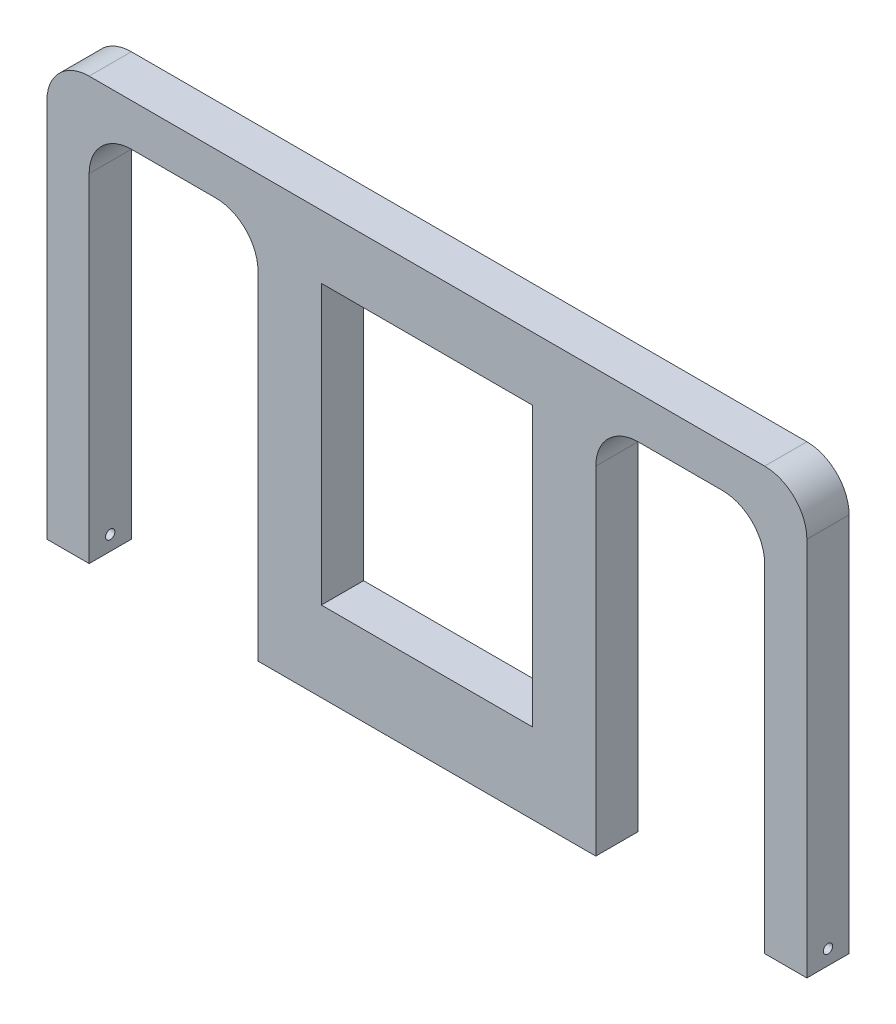
ISO-10303-21;
HEADER;
FILE_DESCRIPTION(('STEP AP214'),'2;1');
FILE_NAME('part.step','',(''),(''),'','','');
FILE_SCHEMA(('AUTOMOTIVE_DESIGN { 1 0 10303 214 1 1 1 1 }'));
ENDSEC;
DATA;
#1=APPLICATION_CONTEXT('core data for automotive mechanical design processes');
#2=APPLICATION_PROTOCOL_DEFINITION('international standard','automotive_design',2000,#1);
#3=PRODUCT_CONTEXT('',#1,'mechanical');
#4=PRODUCT('Part','Part','',(#3));
#5=PRODUCT_RELATED_PRODUCT_CATEGORY('part','',(#4));
#6=PRODUCT_DEFINITION_FORMATION('','',#4);
#7=PRODUCT_DEFINITION_CONTEXT('part definition',#1,'design');
#8=PRODUCT_DEFINITION('design','',#6,#7);
#9=PRODUCT_DEFINITION_SHAPE('','',#8);
#10=(LENGTH_UNIT() NAMED_UNIT(*) SI_UNIT(.MILLI.,.METRE.));
#11=(NAMED_UNIT(*) PLANE_ANGLE_UNIT() SI_UNIT($,.RADIAN.));
#12=(NAMED_UNIT(*) SI_UNIT($,.STERADIAN.) SOLID_ANGLE_UNIT());
#13=UNCERTAINTY_MEASURE_WITH_UNIT(LENGTH_MEASURE(1.E-05),#10,'distance_accuracy_value','');
#14=(GEOMETRIC_REPRESENTATION_CONTEXT(3) GLOBAL_UNCERTAINTY_ASSIGNED_CONTEXT((#13)) GLOBAL_UNIT_ASSIGNED_CONTEXT((#10,
#11,#12)) REPRESENTATION_CONTEXT('',''));
#15=CARTESIAN_POINT('',(0.,0.,0.));
#16=DIRECTION('',(0.,0.,1.));
#17=DIRECTION('',(1.,0.,0.));
#18=AXIS2_PLACEMENT_3D('',#15,#16,#17);
#19=CARTESIAN_POINT('',(-114.3,114.3,12.7));
#20=DIRECTION('',(0.,0.,-1.));
#21=DIRECTION('',(-1.,0.,0.));
#22=AXIS2_PLACEMENT_3D('',#19,#20,#21);
#23=PLANE('',#22);
#24=DIRECTION('',(-1.,0.,0.));
#25=VECTOR('',#24,1.);
#26=CARTESIAN_POINT('',(31.75,24.13,12.7));
#27=LINE('',#26,#25);
#28=CARTESIAN_POINT('',(31.75,24.13,12.7));
#29=VERTEX_POINT('',#28);
#30=CARTESIAN_POINT('',(-31.75,24.13,12.7));
#31=VERTEX_POINT('',#30);
#32=EDGE_CURVE('E189',#29,#31,#27,.T.);
#33=ORIENTED_EDGE('',*,*,#32,.T.);
#34=DIRECTION('',(0.,1.,0.));
#35=VECTOR('',#34,1.);
#36=CARTESIAN_POINT('',(-31.75,107.95,12.7));
#37=LINE('',#36,#35);
#38=CARTESIAN_POINT('',(-31.75,107.95,12.7));
#39=VERTEX_POINT('',#38);
#40=EDGE_CURVE('E183',#31,#39,#37,.T.);
#41=ORIENTED_EDGE('',*,*,#40,.T.);
#42=DIRECTION('',(1.,0.,0.));
#43=VECTOR('',#42,1.);
#44=CARTESIAN_POINT('',(31.75,107.95,12.7));
#45=LINE('',#44,#43);
#46=CARTESIAN_POINT('',(31.75,107.95,12.6999999999999));
#47=VERTEX_POINT('',#46);
#48=EDGE_CURVE('E192',#39,#47,#45,.T.);
#49=ORIENTED_EDGE('',*,*,#48,.T.);
#50=DIRECTION('',(0.,-1.,0.));
#51=VECTOR('',#50,1.);
#52=CARTESIAN_POINT('',(31.75,107.95,12.7));
#53=LINE('',#52,#51);
#54=EDGE_CURVE('E48',#47,#29,#53,.T.);
#55=ORIENTED_EDGE('',*,*,#54,.T.);
#56=EDGE_LOOP('',(#33,#41,#49,#55));
#57=FACE_BOUND('',#56,.T.);
#58=CARTESIAN_POINT('',(-101.6,114.3,12.7));
#59=DIRECTION('',(0.,0.,-1.));
#60=DIRECTION('',(-1.,0.,0.));
#61=AXIS2_PLACEMENT_3D('',#58,#59,#60);
#62=CIRCLE('',#61,12.7);
#63=CARTESIAN_POINT('',(-114.3,114.3,12.7));
#64=VERTEX_POINT('',#63);
#65=CARTESIAN_POINT('',(-101.6,127.,12.7));
#66=VERTEX_POINT('',#65);
#67=EDGE_CURVE('E217',#64,#66,#62,.T.);
#68=ORIENTED_EDGE('',*,*,#67,.F.);
#69=DIRECTION('',(0.,-1.,0.));
#70=VECTOR('',#69,1.);
#71=CARTESIAN_POINT('',(-114.3,114.3,12.7));
#72=LINE('',#71,#70);
#73=CARTESIAN_POINT('',(-114.3,0.,12.7));
#74=VERTEX_POINT('',#73);
#75=EDGE_CURVE('E11',#64,#74,#72,.T.);
#76=ORIENTED_EDGE('',*,*,#75,.T.);
#77=DIRECTION('',(1.,0.,0.));
#78=VECTOR('',#77,1.);
#79=CARTESIAN_POINT('',(-114.3,0.,12.7));
#80=LINE('',#79,#78);
#81=CARTESIAN_POINT('',(-101.6,0.,12.7));
#82=VERTEX_POINT('',#81);
#83=EDGE_CURVE('E349',#74,#82,#80,.T.);
#84=ORIENTED_EDGE('',*,*,#83,.T.);
#85=DIRECTION('',(0.,-1.,0.));
#86=VECTOR('',#85,1.);
#87=CARTESIAN_POINT('',(-101.6,114.3,12.7));
#88=LINE('',#87,#86);
#89=CARTESIAN_POINT('',(-101.6,101.6,12.7));
#90=VERTEX_POINT('',#89);
#91=EDGE_CURVE('E41',#90,#82,#88,.T.);
#92=ORIENTED_EDGE('',*,*,#91,.F.);
#93=CARTESIAN_POINT('',(-88.9,101.6,12.7));
#94=DIRECTION('',(0.,0.,-1.));
#95=DIRECTION('',(-1.,0.,0.));
#96=AXIS2_PLACEMENT_3D('',#93,#94,#95);
#97=CIRCLE('',#96,12.7);
#98=CARTESIAN_POINT('',(-88.9,114.3,12.7));
#99=VERTEX_POINT('',#98);
#100=EDGE_CURVE('E246',#90,#99,#97,.T.);
#101=ORIENTED_EDGE('',*,*,#100,.T.);
#102=DIRECTION('',(-1.,0.,0.));
#103=VECTOR('',#102,1.);
#104=CARTESIAN_POINT('',(114.3,114.3,12.7));
#105=LINE('',#104,#103);
#106=CARTESIAN_POINT('',(-63.5,114.3,12.7));
#107=VERTEX_POINT('',#106);
#108=EDGE_CURVE('E343',#107,#99,#105,.T.);
#109=ORIENTED_EDGE('',*,*,#108,.F.);
#110=CARTESIAN_POINT('',(-63.5,101.6,12.7));
#111=DIRECTION('',(0.,0.,-1.));
#112=DIRECTION('',(1.,0.,0.));
#113=AXIS2_PLACEMENT_3D('',#110,#111,#112);
#114=CIRCLE('',#113,12.7);
#115=CARTESIAN_POINT('',(-50.8,101.6,12.7));
#116=VERTEX_POINT('',#115);
#117=EDGE_CURVE('E237',#107,#116,#114,.T.);
#118=ORIENTED_EDGE('',*,*,#117,.T.);
#119=DIRECTION('',(0.,1.,0.));
#120=VECTOR('',#119,1.);
#121=CARTESIAN_POINT('',(-50.8,0.,12.6999999999999));
#122=LINE('',#121,#120);
#123=CARTESIAN_POINT('',(-50.8,0.,12.6999999999999));
#124=VERTEX_POINT('',#123);
#125=EDGE_CURVE('E301',#124,#116,#122,.T.);
#126=ORIENTED_EDGE('',*,*,#125,.F.);
#127=DIRECTION('',(-1.,0.,0.));
#128=VECTOR('',#127,1.);
#129=CARTESIAN_POINT('',(50.8,0.,12.6999999999999));
#130=LINE('',#129,#128);
#131=CARTESIAN_POINT('',(50.8,0.,12.6999999999999));
#132=VERTEX_POINT('',#131);
#133=EDGE_CURVE('E299',#132,#124,#130,.T.);
#134=ORIENTED_EDGE('',*,*,#133,.F.);
#135=DIRECTION('',(0.,1.,0.));
#136=VECTOR('',#135,1.);
#137=CARTESIAN_POINT('',(50.8,0.,12.6999999999999));
#138=LINE('',#137,#136);
#139=CARTESIAN_POINT('',(50.8,101.6,12.6999999999999));
#140=VERTEX_POINT('',#139);
#141=EDGE_CURVE('E304',#132,#140,#138,.T.);
#142=ORIENTED_EDGE('',*,*,#141,.T.);
#143=CARTESIAN_POINT('',(63.5,101.6,12.7));
#144=DIRECTION('',(0.,0.,1.));
#145=DIRECTION('',(-1.,0.,0.));
#146=AXIS2_PLACEMENT_3D('',#143,#144,#145);
#147=CIRCLE('',#146,12.7);
#148=CARTESIAN_POINT('',(63.5,114.3,12.7));
#149=VERTEX_POINT('',#148);
#150=EDGE_CURVE('E258',#149,#140,#147,.T.);
#151=ORIENTED_EDGE('',*,*,#150,.F.);
#152=CARTESIAN_POINT('',(88.9,114.3,12.6999999999998));
#153=VERTEX_POINT('',#152);
#154=EDGE_CURVE('E341',#153,#149,#105,.T.);
#155=ORIENTED_EDGE('',*,*,#154,.F.);
#156=CARTESIAN_POINT('',(88.9,101.6,12.7));
#157=DIRECTION('',(0.,0.,1.));
#158=DIRECTION('',(1.,0.,0.));
#159=AXIS2_PLACEMENT_3D('',#156,#157,#158);
#160=CIRCLE('',#159,12.7);
#161=CARTESIAN_POINT('',(101.6,101.6,12.7));
#162=VERTEX_POINT('',#161);
#163=EDGE_CURVE('E269',#162,#153,#160,.T.);
#164=ORIENTED_EDGE('',*,*,#163,.F.);
#165=DIRECTION('',(0.,-1.,0.));
#166=VECTOR('',#165,1.);
#167=CARTESIAN_POINT('',(101.6,114.3,12.7));
#168=LINE('',#167,#166);
#169=CARTESIAN_POINT('',(101.6,0.,12.7));
#170=VERTEX_POINT('',#169);
#171=EDGE_CURVE('E324',#162,#170,#168,.T.);
#172=ORIENTED_EDGE('',*,*,#171,.T.);
#173=DIRECTION('',(1.,0.,0.));
#174=VECTOR('',#173,1.);
#175=CARTESIAN_POINT('',(114.3,0.,12.7));
#176=LINE('',#175,#174);
#177=CARTESIAN_POINT('',(114.3,0.,12.7));
#178=VERTEX_POINT('',#177);
#179=EDGE_CURVE('E321',#170,#178,#176,.T.);
#180=ORIENTED_EDGE('',*,*,#179,.T.);
#181=DIRECTION('',(0.,1.,0.));
#182=VECTOR('',#181,1.);
#183=CARTESIAN_POINT('',(114.3,114.3,12.7));
#184=LINE('',#183,#182);
#185=CARTESIAN_POINT('',(114.3,114.3,12.7));
#186=VERTEX_POINT('',#185);
#187=EDGE_CURVE('E330',#178,#186,#184,.T.);
#188=ORIENTED_EDGE('',*,*,#187,.T.);
#189=CARTESIAN_POINT('',(101.6,114.3,12.7));
#190=DIRECTION('',(0.,0.,1.));
#191=DIRECTION('',(1.,0.,0.));
#192=AXIS2_PLACEMENT_3D('',#189,#190,#191);
#193=CIRCLE('',#192,12.7);
#194=CARTESIAN_POINT('',(101.6,127.,12.7));
#195=VERTEX_POINT('',#194);
#196=EDGE_CURVE('E227',#186,#195,#193,.T.);
#197=ORIENTED_EDGE('',*,*,#196,.T.);
#198=DIRECTION('',(-1.,0.,0.));
#199=VECTOR('',#198,1.);
#200=CARTESIAN_POINT('',(114.3,127.,12.7));
#201=LINE('',#200,#199);
#202=EDGE_CURVE('E338',#195,#66,#201,.T.);
#203=ORIENTED_EDGE('',*,*,#202,.T.);
#204=EDGE_LOOP('',(#68,#76,#84,#92,#101,#109,#118,#126,#134,#142,#151,#155,#164,#172,#180,#188,
#197,#203));
#205=FACE_BOUND('',#204,.T.);
#206=ADVANCED_FACE('F33',(#57,#205),#23,.F.);
#207=CARTESIAN_POINT('',(-114.3,114.3,0.));
#208=DIRECTION('',(0.,0.,1.));
#209=DIRECTION('',(1.,0.,0.));
#210=AXIS2_PLACEMENT_3D('',#207,#208,#209);
#211=PLANE('',#210);
#212=DIRECTION('',(1.,0.,0.));
#213=VECTOR('',#212,1.);
#214=CARTESIAN_POINT('',(31.75,107.95,0.));
#215=LINE('',#214,#213);
#216=CARTESIAN_POINT('',(-31.75,107.95,0.));
#217=VERTEX_POINT('',#216);
#218=CARTESIAN_POINT('',(31.75,107.95,0.));
#219=VERTEX_POINT('',#218);
#220=EDGE_CURVE('E207',#217,#219,#215,.T.);
#221=ORIENTED_EDGE('',*,*,#220,.F.);
#222=DIRECTION('',(0.,1.,0.));
#223=VECTOR('',#222,1.);
#224=CARTESIAN_POINT('',(-31.75,107.95,0.));
#225=LINE('',#224,#223);
#226=CARTESIAN_POINT('',(-31.75,24.13,0.));
#227=VERTEX_POINT('',#226);
#228=EDGE_CURVE('E56',#227,#217,#225,.T.);
#229=ORIENTED_EDGE('',*,*,#228,.F.);
#230=DIRECTION('',(-1.,0.,0.));
#231=VECTOR('',#230,1.);
#232=CARTESIAN_POINT('',(31.75,24.13,0.));
#233=LINE('',#232,#231);
#234=CARTESIAN_POINT('',(31.75,24.13,0.));
#235=VERTEX_POINT('',#234);
#236=EDGE_CURVE('E198',#235,#227,#233,.T.);
#237=ORIENTED_EDGE('',*,*,#236,.F.);
#238=DIRECTION('',(0.,-1.,0.));
#239=VECTOR('',#238,1.);
#240=CARTESIAN_POINT('',(31.75,107.95,0.));
#241=LINE('',#240,#239);
#242=EDGE_CURVE('E201',#219,#235,#241,.T.);
#243=ORIENTED_EDGE('',*,*,#242,.F.);
#244=EDGE_LOOP('',(#221,#229,#237,#243));
#245=FACE_BOUND('',#244,.T.);
#246=CARTESIAN_POINT('',(-101.6,114.3,0.));
#247=DIRECTION('',(0.,0.,-1.));
#248=DIRECTION('',(-1.,0.,0.));
#249=AXIS2_PLACEMENT_3D('',#246,#247,#248);
#250=CIRCLE('',#249,12.7);
#251=CARTESIAN_POINT('',(-114.3,114.3,0.));
#252=VERTEX_POINT('',#251);
#253=CARTESIAN_POINT('',(-101.6,127.,0.));
#254=VERTEX_POINT('',#253);
#255=EDGE_CURVE('E213',#252,#254,#250,.T.);
#256=ORIENTED_EDGE('',*,*,#255,.T.);
#257=DIRECTION('',(-1.,0.,0.));
#258=VECTOR('',#257,1.);
#259=CARTESIAN_POINT('',(114.3,127.,0.));
#260=LINE('',#259,#258);
#261=CARTESIAN_POINT('',(101.6,127.,0.));
#262=VERTEX_POINT('',#261);
#263=EDGE_CURVE('E334',#262,#254,#260,.T.);
#264=ORIENTED_EDGE('',*,*,#263,.F.);
#265=CARTESIAN_POINT('',(101.6,114.3,0.));
#266=DIRECTION('',(0.,0.,1.));
#267=DIRECTION('',(1.,0.,0.));
#268=AXIS2_PLACEMENT_3D('',#265,#266,#267);
#269=CIRCLE('',#268,12.7);
#270=CARTESIAN_POINT('',(114.3,114.3,0.));
#271=VERTEX_POINT('',#270);
#272=EDGE_CURVE('E225',#271,#262,#269,.T.);
#273=ORIENTED_EDGE('',*,*,#272,.F.);
#274=DIRECTION('',(0.,-1.,0.));
#275=VECTOR('',#274,1.);
#276=CARTESIAN_POINT('',(114.3,114.3,0.));
#277=LINE('',#276,#275);
#278=CARTESIAN_POINT('',(114.3,0.,0.));
#279=VERTEX_POINT('',#278);
#280=EDGE_CURVE('E328',#271,#279,#277,.T.);
#281=ORIENTED_EDGE('',*,*,#280,.T.);
#282=DIRECTION('',(-1.,0.,0.));
#283=VECTOR('',#282,1.);
#284=CARTESIAN_POINT('',(114.3,0.,0.));
#285=LINE('',#284,#283);
#286=CARTESIAN_POINT('',(101.6,0.,0.));
#287=VERTEX_POINT('',#286);
#288=EDGE_CURVE('E315',#279,#287,#285,.T.);
#289=ORIENTED_EDGE('',*,*,#288,.T.);
#290=DIRECTION('',(0.,-1.,0.));
#291=VECTOR('',#290,1.);
#292=CARTESIAN_POINT('',(101.6,114.3,0.));
#293=LINE('',#292,#291);
#294=CARTESIAN_POINT('',(101.6,101.6,0.));
#295=VERTEX_POINT('',#294);
#296=EDGE_CURVE('E326',#295,#287,#293,.T.);
#297=ORIENTED_EDGE('',*,*,#296,.F.);
#298=CARTESIAN_POINT('',(88.9,101.6,0.));
#299=DIRECTION('',(0.,0.,1.));
#300=DIRECTION('',(1.,0.,0.));
#301=AXIS2_PLACEMENT_3D('',#298,#299,#300);
#302=CIRCLE('',#301,12.7);
#303=CARTESIAN_POINT('',(88.9,114.3,0.));
#304=VERTEX_POINT('',#303);
#305=EDGE_CURVE('E267',#295,#304,#302,.T.);
#306=ORIENTED_EDGE('',*,*,#305,.T.);
#307=DIRECTION('',(-1.,0.,0.));
#308=VECTOR('',#307,1.);
#309=CARTESIAN_POINT('',(114.3,114.3,0.));
#310=LINE('',#309,#308);
#311=CARTESIAN_POINT('',(63.5,114.3,0.));
#312=VERTEX_POINT('',#311);
#313=EDGE_CURVE('E344',#304,#312,#310,.T.);
#314=ORIENTED_EDGE('',*,*,#313,.T.);
#315=CARTESIAN_POINT('',(63.5,101.6,0.));
#316=DIRECTION('',(0.,0.,1.));
#317=DIRECTION('',(-1.,0.,0.));
#318=AXIS2_PLACEMENT_3D('',#315,#316,#317);
#319=CIRCLE('',#318,12.7);
#320=CARTESIAN_POINT('',(50.8,101.6,0.));
#321=VERTEX_POINT('',#320);
#322=EDGE_CURVE('E255',#312,#321,#319,.T.);
#323=ORIENTED_EDGE('',*,*,#322,.T.);
#324=DIRECTION('',(0.,1.,0.));
#325=VECTOR('',#324,1.);
#326=CARTESIAN_POINT('',(50.8,0.,0.));
#327=LINE('',#326,#325);
#328=CARTESIAN_POINT('',(50.8,0.,0.));
#329=VERTEX_POINT('',#328);
#330=EDGE_CURVE('E307',#329,#321,#327,.T.);
#331=ORIENTED_EDGE('',*,*,#330,.F.);
#332=DIRECTION('',(1.,0.,0.));
#333=VECTOR('',#332,1.);
#334=CARTESIAN_POINT('',(50.8,0.,0.));
#335=LINE('',#334,#333);
#336=CARTESIAN_POINT('',(-50.8,0.,0.));
#337=VERTEX_POINT('',#336);
#338=EDGE_CURVE('E295',#337,#329,#335,.T.);
#339=ORIENTED_EDGE('',*,*,#338,.F.);
#340=DIRECTION('',(0.,1.,0.));
#341=VECTOR('',#340,1.);
#342=CARTESIAN_POINT('',(-50.8,0.,0.));
#343=LINE('',#342,#341);
#344=CARTESIAN_POINT('',(-50.8,101.6,0.));
#345=VERTEX_POINT('',#344);
#346=EDGE_CURVE('E309',#337,#345,#343,.T.);
#347=ORIENTED_EDGE('',*,*,#346,.T.);
#348=CARTESIAN_POINT('',(-63.5,101.6,0.));
#349=DIRECTION('',(0.,0.,-1.));
#350=DIRECTION('',(1.,0.,0.));
#351=AXIS2_PLACEMENT_3D('',#348,#349,#350);
#352=CIRCLE('',#351,12.7);
#353=CARTESIAN_POINT('',(-63.5,114.3,0.));
#354=VERTEX_POINT('',#353);
#355=EDGE_CURVE('E235',#354,#345,#352,.T.);
#356=ORIENTED_EDGE('',*,*,#355,.F.);
#357=CARTESIAN_POINT('',(-88.9,114.3,0.));
#358=VERTEX_POINT('',#357);
#359=EDGE_CURVE('E333',#354,#358,#310,.T.);
#360=ORIENTED_EDGE('',*,*,#359,.T.);
#361=CARTESIAN_POINT('',(-88.9,101.6,0.));
#362=DIRECTION('',(0.,0.,-1.));
#363=DIRECTION('',(-1.,0.,0.));
#364=AXIS2_PLACEMENT_3D('',#361,#362,#363);
#365=CIRCLE('',#364,12.7);
#366=CARTESIAN_POINT('',(-101.6,101.6,0.));
#367=VERTEX_POINT('',#366);
#368=EDGE_CURVE('E243',#367,#358,#365,.T.);
#369=ORIENTED_EDGE('',*,*,#368,.F.);
#370=DIRECTION('',(0.,-1.,0.));
#371=VECTOR('',#370,1.);
#372=CARTESIAN_POINT('',(-101.6,114.3,0.));
#373=LINE('',#372,#371);
#374=CARTESIAN_POINT('',(-101.6,0.,0.));
#375=VERTEX_POINT('',#374);
#376=EDGE_CURVE('E360',#367,#375,#373,.T.);
#377=ORIENTED_EDGE('',*,*,#376,.T.);
#378=DIRECTION('',(-1.,0.,0.));
#379=VECTOR('',#378,1.);
#380=CARTESIAN_POINT('',(-114.3,0.,0.));
#381=LINE('',#380,#379);
#382=CARTESIAN_POINT('',(-114.3,0.,0.));
#383=VERTEX_POINT('',#382);
#384=EDGE_CURVE('E355',#375,#383,#381,.T.);
#385=ORIENTED_EDGE('',*,*,#384,.T.);
#386=DIRECTION('',(0.,-1.,0.));
#387=VECTOR('',#386,1.);
#388=CARTESIAN_POINT('',(-114.3,114.3,0.));
#389=LINE('',#388,#387);
#390=EDGE_CURVE('E358',#252,#383,#389,.T.);
#391=ORIENTED_EDGE('',*,*,#390,.F.);
#392=EDGE_LOOP('',(#256,#264,#273,#281,#289,#297,#306,#314,#323,#331,#339,#347,#356,#360,#369,
#377,#385,#391));
#393=FACE_BOUND('',#392,.T.);
#394=ADVANCED_FACE('F376',(#245,#393),#211,.F.);
#395=CARTESIAN_POINT('',(114.3,0.,0.));
#396=DIRECTION('',(1.,0.,0.));
#397=DIRECTION('',(0.,0.,-1.));
#398=AXIS2_PLACEMENT_3D('',#395,#396,#397);
#399=PLANE('',#398);
#400=CARTESIAN_POINT('',(114.3,4.445,6.34999999999997));
#401=DIRECTION('',(1.,0.,0.));
#402=DIRECTION('',(0.,0.,-1.));
#403=AXIS2_PLACEMENT_3D('',#400,#401,#402);
#404=CIRCLE('',#403,1.397);
#405=CARTESIAN_POINT('',(114.3,4.445,4.95299999999997));
#406=VERTEX_POINT('',#405);
#407=EDGE_CURVE('E289',#406,#406,#404,.T.);
#408=ORIENTED_EDGE('',*,*,#407,.F.);
#409=EDGE_LOOP('',(#408));
#410=FACE_BOUND('',#409,.T.);
#411=ORIENTED_EDGE('',*,*,#280,.F.);
#412=DIRECTION('',(0.,0.,-1.));
#413=VECTOR('',#412,1.);
#414=CARTESIAN_POINT('',(114.3,114.3,12.7));
#415=LINE('',#414,#413);
#416=EDGE_CURVE('E230',#186,#271,#415,.T.);
#417=ORIENTED_EDGE('',*,*,#416,.F.);
#418=ORIENTED_EDGE('',*,*,#187,.F.);
#419=DIRECTION('',(0.,0.,-1.));
#420=VECTOR('',#419,1.);
#421=CARTESIAN_POINT('',(114.3,0.,12.7));
#422=LINE('',#421,#420);
#423=EDGE_CURVE('E312',#178,#279,#422,.T.);
#424=ORIENTED_EDGE('',*,*,#423,.T.);
#425=EDGE_LOOP('',(#411,#417,#418,#424));
#426=FACE_BOUND('',#425,.T.);
#427=ADVANCED_FACE('F425',(#410,#426),#399,.T.);
#428=CARTESIAN_POINT('',(114.3,114.3,0.));
#429=DIRECTION('',(0.,-1.,0.));
#430=DIRECTION('',(0.,0.,-1.));
#431=AXIS2_PLACEMENT_3D('',#428,#429,#430);
#432=PLANE('',#431);
#433=DIRECTION('',(0.,0.,-1.));
#434=VECTOR('',#433,1.);
#435=CARTESIAN_POINT('',(-63.5,114.3,12.7));
#436=LINE('',#435,#434);
#437=EDGE_CURVE('E241',#107,#354,#436,.T.);
#438=ORIENTED_EDGE('',*,*,#437,.F.);
#439=ORIENTED_EDGE('',*,*,#108,.T.);
#440=DIRECTION('',(0.,0.,-1.));
#441=VECTOR('',#440,1.);
#442=CARTESIAN_POINT('',(-88.9,114.3,12.7));
#443=LINE('',#442,#441);
#444=EDGE_CURVE('E249',#99,#358,#443,.T.);
#445=ORIENTED_EDGE('',*,*,#444,.T.);
#446=ORIENTED_EDGE('',*,*,#359,.F.);
#447=EDGE_LOOP('',(#438,#439,#445,#446));
#448=FACE_BOUND('',#447,.T.);
#449=ADVANCED_FACE('F387',(#448),#432,.T.);
#450=CARTESIAN_POINT('',(-101.6,114.3,0.));
#451=DIRECTION('',(-1.,0.,0.));
#452=DIRECTION('',(0.,0.,1.));
#453=AXIS2_PLACEMENT_3D('',#450,#451,#452);
#454=PLANE('',#453);
#455=CARTESIAN_POINT('',(-101.6,4.445,6.34999999999997));
#456=DIRECTION('',(-1.,0.,0.));
#457=DIRECTION('',(0.,0.,1.));
#458=AXIS2_PLACEMENT_3D('',#455,#456,#457);
#459=CIRCLE('',#458,1.397);
#460=CARTESIAN_POINT('',(-101.6,4.445,7.74699999999997));
#461=VERTEX_POINT('',#460);
#462=EDGE_CURVE('E281',#461,#461,#459,.T.);
#463=ORIENTED_EDGE('',*,*,#462,.T.);
#464=EDGE_LOOP('',(#463));
#465=FACE_BOUND('',#464,.T.);
#466=DIRECTION('',(0.,0.,-1.));
#467=VECTOR('',#466,1.);
#468=CARTESIAN_POINT('',(-101.6,101.6,12.7));
#469=LINE('',#468,#467);
#470=EDGE_CURVE('E252',#90,#367,#469,.T.);
#471=ORIENTED_EDGE('',*,*,#470,.F.);
#472=ORIENTED_EDGE('',*,*,#91,.T.);
#473=DIRECTION('',(0.,0.,-1.));
#474=VECTOR('',#473,1.);
#475=CARTESIAN_POINT('',(-101.6,0.,0.));
#476=LINE('',#475,#474);
#477=EDGE_CURVE('E352',#82,#375,#476,.T.);
#478=ORIENTED_EDGE('',*,*,#477,.T.);
#479=ORIENTED_EDGE('',*,*,#376,.F.);
#480=EDGE_LOOP('',(#471,#472,#478,#479));
#481=FACE_BOUND('',#480,.T.);
#482=ADVANCED_FACE('F364',(#465,#481),#454,.F.);
#483=DIRECTION('',(0.,0.,-1.));
#484=VECTOR('',#483,1.);
#485=CARTESIAN_POINT('',(63.5,114.3,12.7));
#486=LINE('',#485,#484);
#487=EDGE_CURVE('E261',#149,#312,#486,.T.);
#488=ORIENTED_EDGE('',*,*,#487,.T.);
#489=ORIENTED_EDGE('',*,*,#313,.F.);
#490=DIRECTION('',(0.,0.,-1.));
#491=VECTOR('',#490,1.);
#492=CARTESIAN_POINT('',(88.9,114.3,12.7));
#493=LINE('',#492,#491);
#494=EDGE_CURVE('E275',#153,#304,#493,.T.);
#495=ORIENTED_EDGE('',*,*,#494,.F.);
#496=ORIENTED_EDGE('',*,*,#154,.T.);
#497=EDGE_LOOP('',(#488,#489,#495,#496));
#498=FACE_BOUND('',#497,.T.);
#499=ADVANCED_FACE('F409',(#498),#432,.T.);
#500=CARTESIAN_POINT('',(101.6,114.3,12.7));
#501=DIRECTION('',(1.,0.,0.));
#502=DIRECTION('',(0.,0.,-1.));
#503=AXIS2_PLACEMENT_3D('',#500,#501,#502);
#504=PLANE('',#503);
#505=CARTESIAN_POINT('',(101.6,4.445,6.34999999999997));
#506=DIRECTION('',(1.,0.,0.));
#507=DIRECTION('',(0.,0.,-1.));
#508=AXIS2_PLACEMENT_3D('',#505,#506,#507);
#509=CIRCLE('',#508,1.397);
#510=CARTESIAN_POINT('',(101.6,4.445,4.95299999999997));
#511=VERTEX_POINT('',#510);
#512=EDGE_CURVE('E284',#511,#511,#509,.F.);
#513=ORIENTED_EDGE('',*,*,#512,.F.);
#514=EDGE_LOOP('',(#513));
#515=FACE_BOUND('',#514,.T.);
#516=DIRECTION('',(0.,0.,-1.));
#517=VECTOR('',#516,1.);
#518=CARTESIAN_POINT('',(101.6,101.6,12.7));
#519=LINE('',#518,#517);
#520=EDGE_CURVE('E272',#162,#295,#519,.T.);
#521=ORIENTED_EDGE('',*,*,#520,.T.);
#522=ORIENTED_EDGE('',*,*,#296,.T.);
#523=DIRECTION('',(0.,0.,1.));
#524=VECTOR('',#523,1.);
#525=CARTESIAN_POINT('',(101.6,0.,12.7));
#526=LINE('',#525,#524);
#527=EDGE_CURVE('E318',#287,#170,#526,.T.);
#528=ORIENTED_EDGE('',*,*,#527,.T.);
#529=ORIENTED_EDGE('',*,*,#171,.F.);
#530=EDGE_LOOP('',(#521,#522,#528,#529));
#531=FACE_BOUND('',#530,.T.);
#532=ADVANCED_FACE('F419',(#515,#531),#504,.F.);
#533=CARTESIAN_POINT('',(-114.3,114.3,0.));
#534=DIRECTION('',(1.,0.,0.));
#535=DIRECTION('',(0.,0.,-1.));
#536=AXIS2_PLACEMENT_3D('',#533,#534,#535);
#537=PLANE('',#536);
#538=CARTESIAN_POINT('',(-114.3,4.445,6.34999999999997));
#539=DIRECTION('',(1.,0.,0.));
#540=DIRECTION('',(0.,0.,-1.));
#541=AXIS2_PLACEMENT_3D('',#538,#539,#540);
#542=CIRCLE('',#541,1.397);
#543=CARTESIAN_POINT('',(-114.3,4.445,4.95299999999997));
#544=VERTEX_POINT('',#543);
#545=EDGE_CURVE('E278',#544,#544,#542,.T.);
#546=ORIENTED_EDGE('',*,*,#545,.T.);
#547=EDGE_LOOP('',(#546));
#548=FACE_BOUND('',#547,.T.);
#549=ORIENTED_EDGE('',*,*,#75,.F.);
#550=DIRECTION('',(0.,0.,-1.));
#551=VECTOR('',#550,1.);
#552=CARTESIAN_POINT('',(-114.3,114.3,12.7));
#553=LINE('',#552,#551);
#554=EDGE_CURVE('E222',#64,#252,#553,.T.);
#555=ORIENTED_EDGE('',*,*,#554,.T.);
#556=ORIENTED_EDGE('',*,*,#390,.T.);
#557=DIRECTION('',(0.,0.,1.));
#558=VECTOR('',#557,1.);
#559=CARTESIAN_POINT('',(-114.3,0.,0.));
#560=LINE('',#559,#558);
#561=EDGE_CURVE('E337',#383,#74,#560,.T.);
#562=ORIENTED_EDGE('',*,*,#561,.T.);
#563=EDGE_LOOP('',(#549,#555,#556,#562));
#564=FACE_BOUND('',#563,.T.);
#565=ADVANCED_FACE('F35',(#548,#564),#537,.F.);
#566=CARTESIAN_POINT('',(0.,0.,0.));
#567=DIRECTION('',(0.,1.,0.));
#568=DIRECTION('',(0.,0.,1.));
#569=AXIS2_PLACEMENT_3D('',#566,#567,#568);
#570=PLANE('',#569);
#571=ORIENTED_EDGE('',*,*,#561,.F.);
#572=ORIENTED_EDGE('',*,*,#384,.F.);
#573=ORIENTED_EDGE('',*,*,#477,.F.);
#574=ORIENTED_EDGE('',*,*,#83,.F.);
#575=EDGE_LOOP('',(#571,#572,#573,#574));
#576=FACE_BOUND('',#575,.T.);
#577=ADVANCED_FACE('F373',(#576),#570,.F.);
#578=CARTESIAN_POINT('',(114.3,127.,0.));
#579=DIRECTION('',(0.,1.,0.));
#580=DIRECTION('',(0.,0.,1.));
#581=AXIS2_PLACEMENT_3D('',#578,#579,#580);
#582=PLANE('',#581);
#583=DIRECTION('',(0.,0.,-1.));
#584=VECTOR('',#583,1.);
#585=CARTESIAN_POINT('',(-101.6,127.,12.7));
#586=LINE('',#585,#584);
#587=EDGE_CURVE('E219',#66,#254,#586,.T.);
#588=ORIENTED_EDGE('',*,*,#587,.F.);
#589=ORIENTED_EDGE('',*,*,#202,.F.);
#590=DIRECTION('',(0.,0.,-1.));
#591=VECTOR('',#590,1.);
#592=CARTESIAN_POINT('',(101.6,127.,12.7));
#593=LINE('',#592,#591);
#594=EDGE_CURVE('E232',#195,#262,#593,.T.);
#595=ORIENTED_EDGE('',*,*,#594,.T.);
#596=ORIENTED_EDGE('',*,*,#263,.T.);
#597=EDGE_LOOP('',(#588,#589,#595,#596));
#598=FACE_BOUND('',#597,.T.);
#599=ADVANCED_FACE('F431',(#598),#582,.T.);
#600=CARTESIAN_POINT('',(0.,0.,0.));
#601=DIRECTION('',(0.,1.,0.));
#602=DIRECTION('',(0.,0.,1.));
#603=AXIS2_PLACEMENT_3D('',#600,#601,#602);
#604=PLANE('',#603);
#605=ORIENTED_EDGE('',*,*,#423,.F.);
#606=ORIENTED_EDGE('',*,*,#179,.F.);
#607=ORIENTED_EDGE('',*,*,#527,.F.);
#608=ORIENTED_EDGE('',*,*,#288,.F.);
#609=EDGE_LOOP('',(#605,#606,#607,#608));
#610=FACE_BOUND('',#609,.T.);
#611=ADVANCED_FACE('F422',(#610),#604,.F.);
#612=CARTESIAN_POINT('',(-50.8,0.,12.6999999999999));
#613=DIRECTION('',(1.,0.,0.));
#614=DIRECTION('',(0.,0.,-1.));
#615=AXIS2_PLACEMENT_3D('',#612,#613,#614);
#616=PLANE('',#615);
#617=ORIENTED_EDGE('',*,*,#125,.T.);
#618=DIRECTION('',(0.,0.,-1.));
#619=VECTOR('',#618,1.);
#620=CARTESIAN_POINT('',(-50.8,101.6,12.7));
#621=LINE('',#620,#619);
#622=EDGE_CURVE('E239',#116,#345,#621,.T.);
#623=ORIENTED_EDGE('',*,*,#622,.T.);
#624=ORIENTED_EDGE('',*,*,#346,.F.);
#625=DIRECTION('',(0.,0.,-1.));
#626=VECTOR('',#625,1.);
#627=CARTESIAN_POINT('',(-50.8,0.,12.6999999999999));
#628=LINE('',#627,#626);
#629=EDGE_CURVE('E292',#124,#337,#628,.T.);
#630=ORIENTED_EDGE('',*,*,#629,.F.);
#631=EDGE_LOOP('',(#617,#623,#624,#630));
#632=FACE_BOUND('',#631,.T.);
#633=ADVANCED_FACE('F394',(#632),#616,.F.);
#634=CARTESIAN_POINT('',(50.8,0.,12.6999999999999));
#635=DIRECTION('',(-1.,0.,0.));
#636=DIRECTION('',(0.,0.,1.));
#637=AXIS2_PLACEMENT_3D('',#634,#635,#636);
#638=PLANE('',#637);
#639=ORIENTED_EDGE('',*,*,#330,.T.);
#640=DIRECTION('',(0.,0.,-1.));
#641=VECTOR('',#640,1.);
#642=CARTESIAN_POINT('',(50.8,101.6,12.7));
#643=LINE('',#642,#641);
#644=EDGE_CURVE('E264',#140,#321,#643,.T.);
#645=ORIENTED_EDGE('',*,*,#644,.F.);
#646=ORIENTED_EDGE('',*,*,#141,.F.);
#647=DIRECTION('',(0.,0.,1.));
#648=VECTOR('',#647,1.);
#649=CARTESIAN_POINT('',(50.8,0.,12.6999999999999));
#650=LINE('',#649,#648);
#651=EDGE_CURVE('E297',#329,#132,#650,.T.);
#652=ORIENTED_EDGE('',*,*,#651,.F.);
#653=EDGE_LOOP('',(#639,#645,#646,#652));
#654=FACE_BOUND('',#653,.T.);
#655=ADVANCED_FACE('F402',(#654),#638,.F.);
#656=CARTESIAN_POINT('',(0.,0.,0.));
#657=DIRECTION('',(0.,1.,0.));
#658=DIRECTION('',(0.,0.,1.));
#659=AXIS2_PLACEMENT_3D('',#656,#657,#658);
#660=PLANE('',#659);
#661=ORIENTED_EDGE('',*,*,#629,.T.);
#662=ORIENTED_EDGE('',*,*,#338,.T.);
#663=ORIENTED_EDGE('',*,*,#651,.T.);
#664=ORIENTED_EDGE('',*,*,#133,.T.);
#665=EDGE_LOOP('',(#661,#662,#663,#664));
#666=FACE_BOUND('',#665,.T.);
#667=ADVANCED_FACE('F399',(#666),#660,.F.);
#668=CARTESIAN_POINT('',(-114.301,4.445,6.34999999999997));
#669=DIRECTION('',(1.,0.,0.));
#670=DIRECTION('',(0.,0.,-1.));
#671=AXIS2_PLACEMENT_3D('',#668,#669,#670);
#672=CYLINDRICAL_SURFACE('',#671,1.397);
#673=ORIENTED_EDGE('',*,*,#407,.T.);
#674=EDGE_LOOP('',(#673));
#675=FACE_BOUND('',#674,.T.);
#676=ORIENTED_EDGE('',*,*,#512,.T.);
#677=EDGE_LOOP('',(#676));
#678=FACE_BOUND('',#677,.T.);
#679=ADVANCED_FACE('F475',(#675,#678),#672,.F.);
#680=CARTESIAN_POINT('',(114.301,4.445,6.34999999999997));
#681=DIRECTION('',(-1.,0.,0.));
#682=DIRECTION('',(0.,0.,1.));
#683=AXIS2_PLACEMENT_3D('',#680,#681,#682);
#684=CYLINDRICAL_SURFACE('',#683,1.397);
#685=ORIENTED_EDGE('',*,*,#545,.F.);
#686=EDGE_LOOP('',(#685));
#687=FACE_BOUND('',#686,.T.);
#688=ORIENTED_EDGE('',*,*,#462,.F.);
#689=EDGE_LOOP('',(#688));
#690=FACE_BOUND('',#689,.T.);
#691=ADVANCED_FACE('F478',(#687,#690),#684,.F.);
#692=CARTESIAN_POINT('',(88.9,101.6,12.7));
#693=DIRECTION('',(0.,0.,-1.));
#694=DIRECTION('',(-1.,0.,0.));
#695=AXIS2_PLACEMENT_3D('',#692,#693,#694);
#696=CYLINDRICAL_SURFACE('',#695,12.7);
#697=ORIENTED_EDGE('',*,*,#305,.F.);
#698=ORIENTED_EDGE('',*,*,#520,.F.);
#699=ORIENTED_EDGE('',*,*,#163,.T.);
#700=ORIENTED_EDGE('',*,*,#494,.T.);
#701=EDGE_LOOP('',(#697,#698,#699,#700));
#702=FACE_BOUND('',#701,.T.);
#703=ADVANCED_FACE('F412',(#702),#696,.F.);
#704=CARTESIAN_POINT('',(63.5,101.6,12.7));
#705=DIRECTION('',(0.,0.,-1.));
#706=DIRECTION('',(-1.,0.,0.));
#707=AXIS2_PLACEMENT_3D('',#704,#705,#706);
#708=CYLINDRICAL_SURFACE('',#707,12.7);
#709=ORIENTED_EDGE('',*,*,#322,.F.);
#710=ORIENTED_EDGE('',*,*,#487,.F.);
#711=ORIENTED_EDGE('',*,*,#150,.T.);
#712=ORIENTED_EDGE('',*,*,#644,.T.);
#713=EDGE_LOOP('',(#709,#710,#711,#712));
#714=FACE_BOUND('',#713,.T.);
#715=ADVANCED_FACE('F405',(#714),#708,.F.);
#716=CARTESIAN_POINT('',(-88.9,101.6,12.7));
#717=DIRECTION('',(0.,0.,-1.));
#718=DIRECTION('',(-1.,0.,0.));
#719=AXIS2_PLACEMENT_3D('',#716,#717,#718);
#720=CYLINDRICAL_SURFACE('',#719,12.7);
#721=ORIENTED_EDGE('',*,*,#368,.T.);
#722=ORIENTED_EDGE('',*,*,#444,.F.);
#723=ORIENTED_EDGE('',*,*,#100,.F.);
#724=ORIENTED_EDGE('',*,*,#470,.T.);
#725=EDGE_LOOP('',(#721,#722,#723,#724));
#726=FACE_BOUND('',#725,.T.);
#727=ADVANCED_FACE('F381',(#726),#720,.F.);
#728=CARTESIAN_POINT('',(-63.5,101.6,12.7));
#729=DIRECTION('',(0.,0.,-1.));
#730=DIRECTION('',(-1.,0.,0.));
#731=AXIS2_PLACEMENT_3D('',#728,#729,#730);
#732=CYLINDRICAL_SURFACE('',#731,12.7);
#733=ORIENTED_EDGE('',*,*,#355,.T.);
#734=ORIENTED_EDGE('',*,*,#622,.F.);
#735=ORIENTED_EDGE('',*,*,#117,.F.);
#736=ORIENTED_EDGE('',*,*,#437,.T.);
#737=EDGE_LOOP('',(#733,#734,#735,#736));
#738=FACE_BOUND('',#737,.T.);
#739=ADVANCED_FACE('F389',(#738),#732,.F.);
#740=CARTESIAN_POINT('',(101.6,114.3,12.7));
#741=DIRECTION('',(0.,0.,-1.));
#742=DIRECTION('',(-1.,0.,0.));
#743=AXIS2_PLACEMENT_3D('',#740,#741,#742);
#744=CYLINDRICAL_SURFACE('',#743,12.7);
#745=ORIENTED_EDGE('',*,*,#272,.T.);
#746=ORIENTED_EDGE('',*,*,#594,.F.);
#747=ORIENTED_EDGE('',*,*,#196,.F.);
#748=ORIENTED_EDGE('',*,*,#416,.T.);
#749=EDGE_LOOP('',(#745,#746,#747,#748));
#750=FACE_BOUND('',#749,.T.);
#751=ADVANCED_FACE('F436',(#750),#744,.T.);
#752=CARTESIAN_POINT('',(-101.6,114.3,12.7));
#753=DIRECTION('',(0.,0.,-1.));
#754=DIRECTION('',(-1.,0.,0.));
#755=AXIS2_PLACEMENT_3D('',#752,#753,#754);
#756=CYLINDRICAL_SURFACE('',#755,12.7);
#757=ORIENTED_EDGE('',*,*,#255,.F.);
#758=ORIENTED_EDGE('',*,*,#554,.F.);
#759=ORIENTED_EDGE('',*,*,#67,.T.);
#760=ORIENTED_EDGE('',*,*,#587,.T.);
#761=EDGE_LOOP('',(#757,#758,#759,#760));
#762=FACE_BOUND('',#761,.T.);
#763=ADVANCED_FACE('F434',(#762),#756,.T.);
#764=CARTESIAN_POINT('',(-31.75,107.95,12.7));
#765=DIRECTION('',(-1.,0.,0.));
#766=DIRECTION('',(0.,-1.,0.));
#767=AXIS2_PLACEMENT_3D('',#764,#765,#766);
#768=PLANE('',#767);
#769=ORIENTED_EDGE('',*,*,#228,.T.);
#770=DIRECTION('',(0.,0.,-1.));
#771=VECTOR('',#770,1.);
#772=CARTESIAN_POINT('',(-31.75,107.95,12.7));
#773=LINE('',#772,#771);
#774=EDGE_CURVE('E179',#39,#217,#773,.T.);
#775=ORIENTED_EDGE('',*,*,#774,.F.);
#776=ORIENTED_EDGE('',*,*,#40,.F.);
#777=DIRECTION('',(0.,0.,-1.));
#778=VECTOR('',#777,1.);
#779=CARTESIAN_POINT('',(-31.75,24.13,12.7));
#780=LINE('',#779,#778);
#781=EDGE_CURVE('E211',#31,#227,#780,.T.);
#782=ORIENTED_EDGE('',*,*,#781,.T.);
#783=EDGE_LOOP('',(#769,#775,#776,#782));
#784=FACE_BOUND('',#783,.T.);
#785=ADVANCED_FACE('F181',(#784),#768,.F.);
#786=CARTESIAN_POINT('',(31.75,24.13,12.7));
#787=DIRECTION('',(0.,-1.,0.));
#788=DIRECTION('',(0.,0.,-1.));
#789=AXIS2_PLACEMENT_3D('',#786,#787,#788);
#790=PLANE('',#789);
#791=ORIENTED_EDGE('',*,*,#236,.T.);
#792=ORIENTED_EDGE('',*,*,#781,.F.);
#793=ORIENTED_EDGE('',*,*,#32,.F.);
#794=DIRECTION('',(0.,0.,-1.));
#795=VECTOR('',#794,1.);
#796=CARTESIAN_POINT('',(31.75,24.13,12.7));
#797=LINE('',#796,#795);
#798=EDGE_CURVE('E214',#29,#235,#797,.T.);
#799=ORIENTED_EDGE('',*,*,#798,.T.);
#800=EDGE_LOOP('',(#791,#792,#793,#799));
#801=FACE_BOUND('',#800,.T.);
#802=ADVANCED_FACE('F554',(#801),#790,.F.);
#803=CARTESIAN_POINT('',(31.75,107.95,12.7));
#804=DIRECTION('',(1.,0.,0.));
#805=DIRECTION('',(0.,1.,0.));
#806=AXIS2_PLACEMENT_3D('',#803,#804,#805);
#807=PLANE('',#806);
#808=ORIENTED_EDGE('',*,*,#242,.T.);
#809=ORIENTED_EDGE('',*,*,#798,.F.);
#810=ORIENTED_EDGE('',*,*,#54,.F.);
#811=DIRECTION('',(0.,0.,-1.));
#812=VECTOR('',#811,1.);
#813=CARTESIAN_POINT('',(31.75,107.95,12.7));
#814=LINE('',#813,#812);
#815=EDGE_CURVE('E188',#47,#219,#814,.T.);
#816=ORIENTED_EDGE('',*,*,#815,.T.);
#817=EDGE_LOOP('',(#808,#809,#810,#816));
#818=FACE_BOUND('',#817,.T.);
#819=ADVANCED_FACE('F563',(#818),#807,.F.);
#820=CARTESIAN_POINT('',(31.75,107.95,12.7));
#821=DIRECTION('',(0.,1.,0.));
#822=DIRECTION('',(0.,0.,1.));
#823=AXIS2_PLACEMENT_3D('',#820,#821,#822);
#824=PLANE('',#823);
#825=ORIENTED_EDGE('',*,*,#220,.T.);
#826=ORIENTED_EDGE('',*,*,#815,.F.);
#827=ORIENTED_EDGE('',*,*,#48,.F.);
#828=ORIENTED_EDGE('',*,*,#774,.T.);
#829=EDGE_LOOP('',(#825,#826,#827,#828));
#830=FACE_BOUND('',#829,.T.);
#831=ADVANCED_FACE('F193',(#830),#824,.F.);
#832=CLOSED_SHELL('',(#206,#394,#427,#449,#482,#499,#532,#565,#577,#599,#611,#633,#655,#667,
#679,#691,#703,#715,#727,#739,#751,#763,#785,#802,#819,#831));
#833=MANIFOLD_SOLID_BREP('B2',#832);
#834=ADVANCED_BREP_SHAPE_REPRESENTATION('',(#18,#833),#14);
#835=SHAPE_DEFINITION_REPRESENTATION(#9,#834);
ENDSEC;
END-ISO-10303-21;
